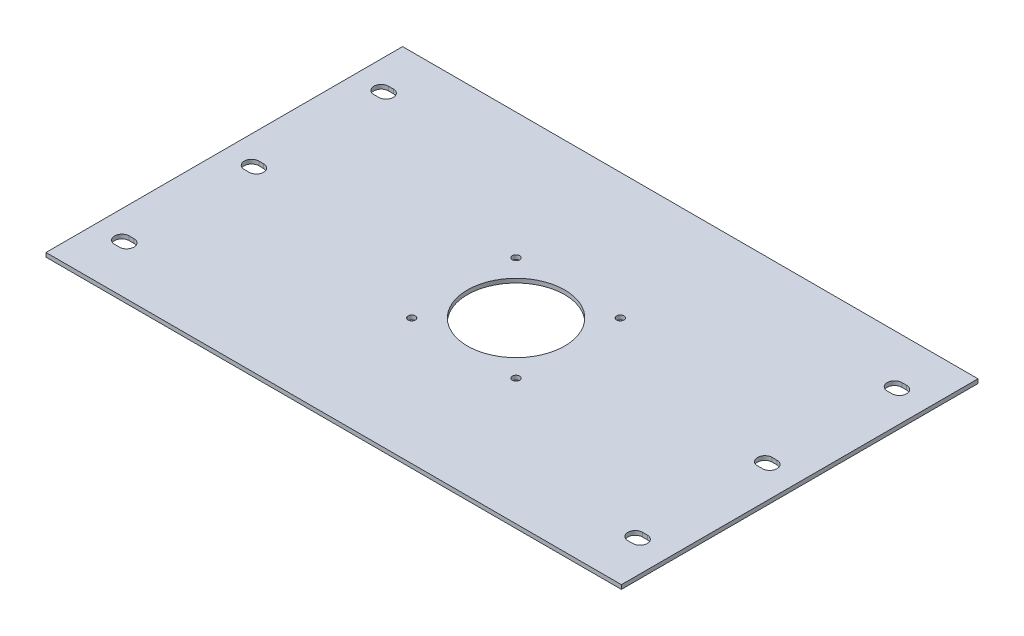
ISO-10303-21;
HEADER;
FILE_DESCRIPTION(('STEP AP214'),'2;1');
FILE_NAME('part.step','',(''),(''),'','','');
FILE_SCHEMA(('AUTOMOTIVE_DESIGN { 1 0 10303 214 1 1 1 1 }'));
ENDSEC;
DATA;
#1=APPLICATION_CONTEXT('core data for automotive mechanical design processes');
#2=APPLICATION_PROTOCOL_DEFINITION('international standard','automotive_design',2000,#1);
#3=PRODUCT_CONTEXT('',#1,'mechanical');
#4=PRODUCT('Part','Part','',(#3));
#5=PRODUCT_RELATED_PRODUCT_CATEGORY('part','',(#4));
#6=PRODUCT_DEFINITION_FORMATION('','',#4);
#7=PRODUCT_DEFINITION_CONTEXT('part definition',#1,'design');
#8=PRODUCT_DEFINITION('design','',#6,#7);
#9=PRODUCT_DEFINITION_SHAPE('','',#8);
#10=(LENGTH_UNIT() NAMED_UNIT(*) SI_UNIT(.MILLI.,.METRE.));
#11=(NAMED_UNIT(*) PLANE_ANGLE_UNIT() SI_UNIT($,.RADIAN.));
#12=(NAMED_UNIT(*) SI_UNIT($,.STERADIAN.) SOLID_ANGLE_UNIT());
#13=UNCERTAINTY_MEASURE_WITH_UNIT(LENGTH_MEASURE(1.E-05),#10,'distance_accuracy_value','');
#14=(GEOMETRIC_REPRESENTATION_CONTEXT(3) GLOBAL_UNCERTAINTY_ASSIGNED_CONTEXT((#13)) GLOBAL_UNIT_ASSIGNED_CONTEXT((#10,
#11,#12)) REPRESENTATION_CONTEXT('',''));
#15=CARTESIAN_POINT('',(0.,0.,0.));
#16=DIRECTION('',(0.,0.,1.));
#17=DIRECTION('',(1.,0.,0.));
#18=AXIS2_PLACEMENT_3D('',#15,#16,#17);
#19=CARTESIAN_POINT('',(0.,2.54,0.));
#20=DIRECTION('',(0.,1.,0.));
#21=DIRECTION('',(0.,0.,1.));
#22=AXIS2_PLACEMENT_3D('',#19,#20,#21);
#23=PLANE('',#22);
#24=CARTESIAN_POINT('',(147.121823505015,2.54,91.5096177824938));
#25=DIRECTION('',(0.,1.,0.));
#26=DIRECTION('',(0.,0.,1.));
#27=AXIS2_PLACEMENT_3D('',#24,#25,#26);
#28=CIRCLE('',#27,4.5);
#29=CARTESIAN_POINT('',(147.121823505015,2.54,87.0096177824938));
#30=VERTEX_POINT('',#29);
#31=CARTESIAN_POINT('',(147.121823505015,2.54,96.0096177824938));
#32=VERTEX_POINT('',#31);
#33=EDGE_CURVE('E679',#30,#32,#28,.T.);
#34=ORIENTED_EDGE('',*,*,#33,.F.);
#35=DIRECTION('',(-1.,0.,0.));
#36=VECTOR('',#35,1.);
#37=CARTESIAN_POINT('',(150.121823505015,2.54,87.0096177824938));
#38=LINE('',#37,#36);
#39=CARTESIAN_POINT('',(150.121823505015,2.54,87.0096177824938));
#40=VERTEX_POINT('',#39);
#41=EDGE_CURVE('E664',#40,#30,#38,.T.);
#42=ORIENTED_EDGE('',*,*,#41,.F.);
#43=CARTESIAN_POINT('',(150.121823505015,2.54,91.5096177824938));
#44=DIRECTION('',(0.,1.,0.));
#45=DIRECTION('',(0.,0.,1.));
#46=AXIS2_PLACEMENT_3D('',#43,#44,#45);
#47=CIRCLE('',#46,4.5);
#48=CARTESIAN_POINT('',(150.121823505015,2.54,96.0096177824938));
#49=VERTEX_POINT('',#48);
#50=EDGE_CURVE('E668',#49,#40,#47,.T.);
#51=ORIENTED_EDGE('',*,*,#50,.F.);
#52=DIRECTION('',(-1.,0.,0.));
#53=VECTOR('',#52,1.);
#54=CARTESIAN_POINT('',(150.121823505015,2.54,96.0096177824938));
#55=LINE('',#54,#53);
#56=EDGE_CURVE('E674',#49,#32,#55,.T.);
#57=ORIENTED_EDGE('',*,*,#56,.T.);
#58=EDGE_LOOP('',(#34,#42,#51,#57));
#59=FACE_BOUND('',#58,.T.);
#60=CARTESIAN_POINT('',(147.121823505015,2.54,11.5096177824938));
#61=DIRECTION('',(0.,1.,0.));
#62=DIRECTION('',(0.,0.,1.));
#63=AXIS2_PLACEMENT_3D('',#60,#61,#62);
#64=CIRCLE('',#63,4.5);
#65=CARTESIAN_POINT('',(147.121823505015,2.54,7.00961778249384));
#66=VERTEX_POINT('',#65);
#67=CARTESIAN_POINT('',(147.121823505015,2.54,16.0096177824938));
#68=VERTEX_POINT('',#67);
#69=EDGE_CURVE('E700',#66,#68,#64,.T.);
#70=ORIENTED_EDGE('',*,*,#69,.F.);
#71=DIRECTION('',(-1.,0.,0.));
#72=VECTOR('',#71,1.);
#73=CARTESIAN_POINT('',(150.121823505015,2.54,7.00961778249384));
#74=LINE('',#73,#72);
#75=CARTESIAN_POINT('',(150.121823505015,2.54,7.00961778249384));
#76=VERTEX_POINT('',#75);
#77=EDGE_CURVE('E688',#76,#66,#74,.T.);
#78=ORIENTED_EDGE('',*,*,#77,.F.);
#79=CARTESIAN_POINT('',(150.121823505015,2.54,11.5096177824938));
#80=DIRECTION('',(0.,1.,0.));
#81=DIRECTION('',(0.,0.,1.));
#82=AXIS2_PLACEMENT_3D('',#79,#80,#81);
#83=CIRCLE('',#82,4.5);
#84=CARTESIAN_POINT('',(150.121823505015,2.54,16.0096177824938));
#85=VERTEX_POINT('',#84);
#86=EDGE_CURVE('E693',#85,#76,#83,.T.);
#87=ORIENTED_EDGE('',*,*,#86,.F.);
#88=DIRECTION('',(-1.,0.,0.));
#89=VECTOR('',#88,1.);
#90=CARTESIAN_POINT('',(150.121823505015,2.54,16.0096177824938));
#91=LINE('',#90,#89);
#92=EDGE_CURVE('E690',#85,#68,#91,.T.);
#93=ORIENTED_EDGE('',*,*,#92,.T.);
#94=EDGE_LOOP('',(#70,#78,#87,#93));
#95=FACE_BOUND('',#94,.T.);
#96=CARTESIAN_POINT('',(147.121823505015,2.54,-68.4903822175062));
#97=DIRECTION('',(0.,1.,0.));
#98=DIRECTION('',(0.,0.,1.));
#99=AXIS2_PLACEMENT_3D('',#96,#97,#98);
#100=CIRCLE('',#99,4.5);
#101=CARTESIAN_POINT('',(147.121823505015,2.54,-72.9903822175062));
#102=VERTEX_POINT('',#101);
#103=CARTESIAN_POINT('',(147.121823505015,2.54,-63.9903822175062));
#104=VERTEX_POINT('',#103);
#105=EDGE_CURVE('E720',#102,#104,#100,.T.);
#106=ORIENTED_EDGE('',*,*,#105,.F.);
#107=DIRECTION('',(-1.,0.,0.));
#108=VECTOR('',#107,1.);
#109=CARTESIAN_POINT('',(150.121823505015,2.54,-72.9903822175062));
#110=LINE('',#109,#108);
#111=CARTESIAN_POINT('',(150.121823505015,2.54,-72.9903822175062));
#112=VERTEX_POINT('',#111);
#113=EDGE_CURVE('E708',#112,#102,#110,.T.);
#114=ORIENTED_EDGE('',*,*,#113,.F.);
#115=CARTESIAN_POINT('',(150.121823505015,2.54,-68.4903822175062));
#116=DIRECTION('',(0.,1.,0.));
#117=DIRECTION('',(0.,0.,1.));
#118=AXIS2_PLACEMENT_3D('',#115,#116,#117);
#119=CIRCLE('',#118,4.5);
#120=CARTESIAN_POINT('',(150.121823505015,2.54,-63.9903822175062));
#121=VERTEX_POINT('',#120);
#122=EDGE_CURVE('E713',#121,#112,#119,.T.);
#123=ORIENTED_EDGE('',*,*,#122,.F.);
#124=DIRECTION('',(-1.,0.,0.));
#125=VECTOR('',#124,1.);
#126=CARTESIAN_POINT('',(150.121823505015,2.54,-63.9903822175062));
#127=LINE('',#126,#125);
#128=EDGE_CURVE('E710',#121,#104,#127,.T.);
#129=ORIENTED_EDGE('',*,*,#128,.T.);
#130=EDGE_LOOP('',(#106,#114,#123,#129));
#131=FACE_BOUND('',#130,.T.);
#132=CARTESIAN_POINT('',(-169.579279891369,2.54,11.5096177824938));
#133=DIRECTION('',(0.,1.,0.));
#134=DIRECTION('',(0.,0.,1.));
#135=AXIS2_PLACEMENT_3D('',#132,#133,#134);
#136=CIRCLE('',#135,4.5);
#137=CARTESIAN_POINT('',(-169.579279891369,2.54,7.00961778249384));
#138=VERTEX_POINT('',#137);
#139=CARTESIAN_POINT('',(-169.579279891369,2.54,16.0096177824938));
#140=VERTEX_POINT('',#139);
#141=EDGE_CURVE('E740',#138,#140,#136,.T.);
#142=ORIENTED_EDGE('',*,*,#141,.F.);
#143=DIRECTION('',(-1.,0.,0.));
#144=VECTOR('',#143,1.);
#145=CARTESIAN_POINT('',(-166.579279891369,2.54,7.00961778249384));
#146=LINE('',#145,#144);
#147=CARTESIAN_POINT('',(-166.579279891369,2.54,7.0096177824938));
#148=VERTEX_POINT('',#147);
#149=EDGE_CURVE('E728',#148,#138,#146,.T.);
#150=ORIENTED_EDGE('',*,*,#149,.F.);
#151=CARTESIAN_POINT('',(-166.579279891369,2.54,11.5096177824938));
#152=DIRECTION('',(0.,1.,0.));
#153=DIRECTION('',(0.,0.,1.));
#154=AXIS2_PLACEMENT_3D('',#151,#152,#153);
#155=CIRCLE('',#154,4.5);
#156=CARTESIAN_POINT('',(-166.579279891369,2.54,16.0096177824938));
#157=VERTEX_POINT('',#156);
#158=EDGE_CURVE('E733',#157,#148,#155,.T.);
#159=ORIENTED_EDGE('',*,*,#158,.F.);
#160=DIRECTION('',(-1.,0.,0.));
#161=VECTOR('',#160,1.);
#162=CARTESIAN_POINT('',(-166.579279891369,2.54,16.0096177824938));
#163=LINE('',#162,#161);
#164=EDGE_CURVE('E730',#157,#140,#163,.T.);
#165=ORIENTED_EDGE('',*,*,#164,.T.);
#166=EDGE_LOOP('',(#142,#150,#159,#165));
#167=FACE_BOUND('',#166,.T.);
#168=CARTESIAN_POINT('',(-169.579279891369,2.54,91.5096177824938));
#169=DIRECTION('',(0.,1.,0.));
#170=DIRECTION('',(0.,0.,1.));
#171=AXIS2_PLACEMENT_3D('',#168,#169,#170);
#172=CIRCLE('',#171,4.5);
#173=CARTESIAN_POINT('',(-169.579279891369,2.54,87.0096177824938));
#174=VERTEX_POINT('',#173);
#175=CARTESIAN_POINT('',(-169.579279891369,2.54,96.0096177824938));
#176=VERTEX_POINT('',#175);
#177=EDGE_CURVE('E761',#174,#176,#172,.T.);
#178=ORIENTED_EDGE('',*,*,#177,.F.);
#179=DIRECTION('',(-1.,0.,0.));
#180=VECTOR('',#179,1.);
#181=CARTESIAN_POINT('',(-166.579279891369,2.54,87.0096177824938));
#182=LINE('',#181,#180);
#183=CARTESIAN_POINT('',(-166.579279891369,2.54,87.0096177824938));
#184=VERTEX_POINT('',#183);
#185=EDGE_CURVE('E748',#184,#174,#182,.T.);
#186=ORIENTED_EDGE('',*,*,#185,.F.);
#187=CARTESIAN_POINT('',(-166.579279891369,2.54,91.5096177824938));
#188=DIRECTION('',(0.,1.,0.));
#189=DIRECTION('',(0.,0.,1.));
#190=AXIS2_PLACEMENT_3D('',#187,#188,#189);
#191=CIRCLE('',#190,4.5);
#192=CARTESIAN_POINT('',(-166.579279891369,2.54,96.0096177824938));
#193=VERTEX_POINT('',#192);
#194=EDGE_CURVE('E753',#193,#184,#191,.T.);
#195=ORIENTED_EDGE('',*,*,#194,.F.);
#196=DIRECTION('',(-1.,0.,0.));
#197=VECTOR('',#196,1.);
#198=CARTESIAN_POINT('',(-166.579279891369,2.54,96.0096177824938));
#199=LINE('',#198,#197);
#200=EDGE_CURVE('E750',#193,#176,#199,.T.);
#201=ORIENTED_EDGE('',*,*,#200,.T.);
#202=EDGE_LOOP('',(#178,#186,#195,#201));
#203=FACE_BOUND('',#202,.T.);
#204=CARTESIAN_POINT('',(25.7968235050178,2.54,-20.6653822175063));
#205=DIRECTION('',(0.,-1.,0.));
#206=DIRECTION('',(0.,0.,-1.));
#207=AXIS2_PLACEMENT_3D('',#204,#205,#206);
#208=CIRCLE('',#207,2.25);
#209=CARTESIAN_POINT('',(25.7968235050178,2.54,-22.9153822175063));
#210=VERTEX_POINT('',#209);
#211=EDGE_CURVE('E835',#210,#210,#208,.T.);
#212=ORIENTED_EDGE('',*,*,#211,.T.);
#213=EDGE_LOOP('',(#212));
#214=FACE_BOUND('',#213,.T.);
#215=CARTESIAN_POINT('',(25.7968235050178,2.54,43.6846177824982));
#216=DIRECTION('',(0.,-1.,0.));
#217=DIRECTION('',(0.,0.,-1.));
#218=AXIS2_PLACEMENT_3D('',#215,#216,#217);
#219=CIRCLE('',#218,2.25);
#220=CARTESIAN_POINT('',(25.7968235050178,2.54,41.4346177824982));
#221=VERTEX_POINT('',#220);
#222=EDGE_CURVE('E842',#221,#221,#219,.T.);
#223=ORIENTED_EDGE('',*,*,#222,.T.);
#224=EDGE_LOOP('',(#223));
#225=FACE_BOUND('',#224,.T.);
#226=CARTESIAN_POINT('',(-6.37817649498451,2.54,11.5096177824959));
#227=DIRECTION('',(0.,-1.,0.));
#228=DIRECTION('',(0.,0.,-1.));
#229=AXIS2_PLACEMENT_3D('',#226,#227,#228);
#230=CIRCLE('',#229,30.);
#231=CARTESIAN_POINT('',(-6.37817649498451,2.54,-18.4903822175041));
#232=VERTEX_POINT('',#231);
#233=EDGE_CURVE('E823',#232,#232,#230,.T.);
#234=ORIENTED_EDGE('',*,*,#233,.T.);
#235=EDGE_LOOP('',(#234));
#236=FACE_BOUND('',#235,.T.);
#237=CARTESIAN_POINT('',(-38.5531764949868,2.54,43.6846177824982));
#238=DIRECTION('',(0.,-1.,0.));
#239=DIRECTION('',(0.,0.,-1.));
#240=AXIS2_PLACEMENT_3D('',#237,#238,#239);
#241=CIRCLE('',#240,2.25);
#242=CARTESIAN_POINT('',(-38.5531764949868,2.54,41.4346177824982));
#243=VERTEX_POINT('',#242);
#244=EDGE_CURVE('E829',#243,#243,#241,.T.);
#245=ORIENTED_EDGE('',*,*,#244,.T.);
#246=EDGE_LOOP('',(#245));
#247=FACE_BOUND('',#246,.T.);
#248=CARTESIAN_POINT('',(-38.5531764949868,2.54,-20.6653822175063));
#249=DIRECTION('',(0.,-1.,0.));
#250=DIRECTION('',(0.,0.,-1.));
#251=AXIS2_PLACEMENT_3D('',#248,#249,#250);
#252=CIRCLE('',#251,2.25);
#253=CARTESIAN_POINT('',(-38.5531764949868,2.54,-22.9153822175064));
#254=VERTEX_POINT('',#253);
#255=EDGE_CURVE('E847',#254,#254,#252,.T.);
#256=ORIENTED_EDGE('',*,*,#255,.T.);
#257=EDGE_LOOP('',(#256));
#258=FACE_BOUND('',#257,.T.);
#259=DIRECTION('',(0.,0.,1.));
#260=VECTOR('',#259,1.);
#261=CARTESIAN_POINT('',(-186.378176494985,2.54,61.5096177824938));
#262=LINE('',#261,#260);
#263=CARTESIAN_POINT('',(-186.378176494985,2.54,-98.4903822175062));
#264=VERTEX_POINT('',#263);
#265=CARTESIAN_POINT('',(-186.378176494985,2.54,121.509617782494));
#266=VERTEX_POINT('',#265);
#267=EDGE_CURVE('E819',#264,#266,#262,.T.);
#268=ORIENTED_EDGE('',*,*,#267,.T.);
#269=DIRECTION('',(-1.,0.,0.));
#270=VECTOR('',#269,1.);
#271=CARTESIAN_POINT('',(168.621823505015,2.54,121.509617782494));
#272=LINE('',#271,#270);
#273=CARTESIAN_POINT('',(168.621823505015,2.54,121.509617782494));
#274=VERTEX_POINT('',#273);
#275=EDGE_CURVE('E793',#274,#266,#272,.T.);
#276=ORIENTED_EDGE('',*,*,#275,.F.);
#277=DIRECTION('',(0.,0.,1.));
#278=VECTOR('',#277,1.);
#279=CARTESIAN_POINT('',(168.621823505015,2.54,61.5096177824938));
#280=LINE('',#279,#278);
#281=CARTESIAN_POINT('',(168.621823505015,2.54,-98.4903822175062));
#282=VERTEX_POINT('',#281);
#283=EDGE_CURVE('E816',#282,#274,#280,.T.);
#284=ORIENTED_EDGE('',*,*,#283,.F.);
#285=DIRECTION('',(1.,0.,0.));
#286=VECTOR('',#285,1.);
#287=CARTESIAN_POINT('',(-186.378176494985,2.54,-98.4903822175062));
#288=LINE('',#287,#286);
#289=EDGE_CURVE('E805',#264,#282,#288,.T.);
#290=ORIENTED_EDGE('',*,*,#289,.F.);
#291=EDGE_LOOP('',(#268,#276,#284,#290));
#292=FACE_BOUND('',#291,.T.);
#293=CARTESIAN_POINT('',(-166.579279891369,2.54,-68.4903822175062));
#294=DIRECTION('',(0.,1.,0.));
#295=DIRECTION('',(0.,0.,1.));
#296=AXIS2_PLACEMENT_3D('',#293,#294,#295);
#297=CIRCLE('',#296,4.5);
#298=CARTESIAN_POINT('',(-166.579279891369,2.54,-63.9903822175062));
#299=VERTEX_POINT('',#298);
#300=CARTESIAN_POINT('',(-166.579279891369,2.54,-72.9903822175062));
#301=VERTEX_POINT('',#300);
#302=EDGE_CURVE('E774',#299,#301,#297,.T.);
#303=ORIENTED_EDGE('',*,*,#302,.F.);
#304=DIRECTION('',(-1.,0.,0.));
#305=VECTOR('',#304,1.);
#306=CARTESIAN_POINT('',(-166.579279891369,2.54,-63.9903822175062));
#307=LINE('',#306,#305);
#308=CARTESIAN_POINT('',(-169.579279891369,2.54,-63.9903822175062));
#309=VERTEX_POINT('',#308);
#310=EDGE_CURVE('E771',#299,#309,#307,.T.);
#311=ORIENTED_EDGE('',*,*,#310,.T.);
#312=CARTESIAN_POINT('',(-169.579279891369,2.54,-68.4903822175062));
#313=DIRECTION('',(0.,1.,0.));
#314=DIRECTION('',(0.,0.,1.));
#315=AXIS2_PLACEMENT_3D('',#312,#313,#314);
#316=CIRCLE('',#315,4.5);
#317=CARTESIAN_POINT('',(-169.579279891369,2.54,-72.9903822175062));
#318=VERTEX_POINT('',#317);
#319=EDGE_CURVE('E782',#318,#309,#316,.T.);
#320=ORIENTED_EDGE('',*,*,#319,.F.);
#321=DIRECTION('',(-1.,0.,0.));
#322=VECTOR('',#321,1.);
#323=CARTESIAN_POINT('',(-166.579279891369,2.54,-72.9903822175062));
#324=LINE('',#323,#322);
#325=EDGE_CURVE('E769',#301,#318,#324,.T.);
#326=ORIENTED_EDGE('',*,*,#325,.F.);
#327=EDGE_LOOP('',(#303,#311,#320,#326));
#328=FACE_BOUND('',#327,.T.);
#329=ADVANCED_FACE('F477',(#59,#95,#131,#167,#203,#214,#225,#236,#247,#258,#292,#328),#23,.T.);
#330=CARTESIAN_POINT('',(0.,0.,0.));
#331=DIRECTION('',(0.,1.,0.));
#332=DIRECTION('',(0.,0.,1.));
#333=AXIS2_PLACEMENT_3D('',#330,#331,#332);
#334=PLANE('',#333);
#335=DIRECTION('',(-1.,0.,0.));
#336=VECTOR('',#335,1.);
#337=CARTESIAN_POINT('',(0.,0.,87.0096177824938));
#338=LINE('',#337,#336);
#339=CARTESIAN_POINT('',(150.121823505015,0.,87.0096177824938));
#340=VERTEX_POINT('',#339);
#341=CARTESIAN_POINT('',(147.121823505015,0.,87.0096177824938));
#342=VERTEX_POINT('',#341);
#343=EDGE_CURVE('E666',#340,#342,#338,.T.);
#344=ORIENTED_EDGE('',*,*,#343,.T.);
#345=CARTESIAN_POINT('',(147.121823505015,0.,91.5096177824938));
#346=DIRECTION('',(0.,1.,0.));
#347=DIRECTION('',(0.,0.,1.));
#348=AXIS2_PLACEMENT_3D('',#345,#346,#347);
#349=CIRCLE('',#348,4.5);
#350=CARTESIAN_POINT('',(147.121823505015,0.,96.0096177824938));
#351=VERTEX_POINT('',#350);
#352=EDGE_CURVE('E13',#342,#351,#349,.T.);
#353=ORIENTED_EDGE('',*,*,#352,.T.);
#354=DIRECTION('',(1.,0.,0.));
#355=VECTOR('',#354,1.);
#356=CARTESIAN_POINT('',(0.,0.,96.0096177824938));
#357=LINE('',#356,#355);
#358=CARTESIAN_POINT('',(150.121823505015,0.,96.0096177824938));
#359=VERTEX_POINT('',#358);
#360=EDGE_CURVE('E485',#351,#359,#357,.T.);
#361=ORIENTED_EDGE('',*,*,#360,.T.);
#362=CARTESIAN_POINT('',(150.121823505015,0.,91.5096177824938));
#363=DIRECTION('',(0.,1.,0.));
#364=DIRECTION('',(0.,0.,1.));
#365=AXIS2_PLACEMENT_3D('',#362,#363,#364);
#366=CIRCLE('',#365,4.5);
#367=EDGE_CURVE('E913',#359,#340,#366,.T.);
#368=ORIENTED_EDGE('',*,*,#367,.T.);
#369=EDGE_LOOP('',(#344,#353,#361,#368));
#370=FACE_BOUND('',#369,.T.);
#371=DIRECTION('',(-1.,0.,0.));
#372=VECTOR('',#371,1.);
#373=CARTESIAN_POINT('',(0.,0.,7.0096177824938));
#374=LINE('',#373,#372);
#375=CARTESIAN_POINT('',(150.121823505015,0.,7.0096177824938));
#376=VERTEX_POINT('',#375);
#377=CARTESIAN_POINT('',(147.121823505015,0.,7.0096177824938));
#378=VERTEX_POINT('',#377);
#379=EDGE_CURVE('E906',#376,#378,#374,.T.);
#380=ORIENTED_EDGE('',*,*,#379,.T.);
#381=CARTESIAN_POINT('',(147.121823505015,0.,11.5096177824938));
#382=DIRECTION('',(0.,1.,0.));
#383=DIRECTION('',(0.,0.,1.));
#384=AXIS2_PLACEMENT_3D('',#381,#382,#383);
#385=CIRCLE('',#384,4.5);
#386=CARTESIAN_POINT('',(147.121823505015,0.,16.0096177824938));
#387=VERTEX_POINT('',#386);
#388=EDGE_CURVE('E909',#378,#387,#385,.T.);
#389=ORIENTED_EDGE('',*,*,#388,.T.);
#390=DIRECTION('',(1.,0.,0.));
#391=VECTOR('',#390,1.);
#392=CARTESIAN_POINT('',(0.,0.,16.0096177824938));
#393=LINE('',#392,#391);
#394=CARTESIAN_POINT('',(150.121823505015,0.,16.0096177824938));
#395=VERTEX_POINT('',#394);
#396=EDGE_CURVE('E900',#387,#395,#393,.T.);
#397=ORIENTED_EDGE('',*,*,#396,.T.);
#398=CARTESIAN_POINT('',(150.121823505015,0.,11.5096177824938));
#399=DIRECTION('',(0.,1.,0.));
#400=DIRECTION('',(0.,0.,1.));
#401=AXIS2_PLACEMENT_3D('',#398,#399,#400);
#402=CIRCLE('',#401,4.5);
#403=EDGE_CURVE('E903',#395,#376,#402,.T.);
#404=ORIENTED_EDGE('',*,*,#403,.T.);
#405=EDGE_LOOP('',(#380,#389,#397,#404));
#406=FACE_BOUND('',#405,.T.);
#407=DIRECTION('',(-1.,0.,0.));
#408=VECTOR('',#407,1.);
#409=CARTESIAN_POINT('',(0.,0.,-72.9903822175062));
#410=LINE('',#409,#408);
#411=CARTESIAN_POINT('',(150.121823505015,0.,-72.9903822175062));
#412=VERTEX_POINT('',#411);
#413=CARTESIAN_POINT('',(147.121823505015,0.,-72.9903822175062));
#414=VERTEX_POINT('',#413);
#415=EDGE_CURVE('E894',#412,#414,#410,.T.);
#416=ORIENTED_EDGE('',*,*,#415,.T.);
#417=CARTESIAN_POINT('',(147.121823505015,0.,-68.4903822175062));
#418=DIRECTION('',(0.,1.,0.));
#419=DIRECTION('',(0.,0.,1.));
#420=AXIS2_PLACEMENT_3D('',#417,#418,#419);
#421=CIRCLE('',#420,4.5);
#422=CARTESIAN_POINT('',(147.121823505015,0.,-63.9903822175062));
#423=VERTEX_POINT('',#422);
#424=EDGE_CURVE('E897',#414,#423,#421,.T.);
#425=ORIENTED_EDGE('',*,*,#424,.T.);
#426=DIRECTION('',(1.,0.,0.));
#427=VECTOR('',#426,1.);
#428=CARTESIAN_POINT('',(0.,0.,-63.9903822175062));
#429=LINE('',#428,#427);
#430=CARTESIAN_POINT('',(150.121823505015,0.,-63.9903822175062));
#431=VERTEX_POINT('',#430);
#432=EDGE_CURVE('E888',#423,#431,#429,.T.);
#433=ORIENTED_EDGE('',*,*,#432,.T.);
#434=CARTESIAN_POINT('',(150.121823505015,0.,-68.4903822175062));
#435=DIRECTION('',(0.,1.,0.));
#436=DIRECTION('',(0.,0.,1.));
#437=AXIS2_PLACEMENT_3D('',#434,#435,#436);
#438=CIRCLE('',#437,4.5);
#439=EDGE_CURVE('E891',#431,#412,#438,.T.);
#440=ORIENTED_EDGE('',*,*,#439,.T.);
#441=EDGE_LOOP('',(#416,#425,#433,#440));
#442=FACE_BOUND('',#441,.T.);
#443=CARTESIAN_POINT('',(-166.579279891369,0.,11.5096177824938));
#444=DIRECTION('',(0.,1.,0.));
#445=DIRECTION('',(0.,0.,1.));
#446=AXIS2_PLACEMENT_3D('',#443,#444,#445);
#447=CIRCLE('',#446,4.5);
#448=CARTESIAN_POINT('',(-166.579279891369,0.,16.0096177824938));
#449=VERTEX_POINT('',#448);
#450=CARTESIAN_POINT('',(-166.579279891369,0.,7.0096177824938));
#451=VERTEX_POINT('',#450);
#452=EDGE_CURVE('E879',#449,#451,#447,.T.);
#453=ORIENTED_EDGE('',*,*,#452,.T.);
#454=DIRECTION('',(-1.,0.,0.));
#455=VECTOR('',#454,1.);
#456=CARTESIAN_POINT('',(0.,0.,7.0096177824938));
#457=LINE('',#456,#455);
#458=CARTESIAN_POINT('',(-169.579279891369,0.,7.0096177824938));
#459=VERTEX_POINT('',#458);
#460=EDGE_CURVE('E885',#451,#459,#457,.T.);
#461=ORIENTED_EDGE('',*,*,#460,.T.);
#462=CARTESIAN_POINT('',(-169.579279891369,0.,11.5096177824938));
#463=DIRECTION('',(0.,1.,0.));
#464=DIRECTION('',(0.,0.,1.));
#465=AXIS2_PLACEMENT_3D('',#462,#463,#464);
#466=CIRCLE('',#465,4.5);
#467=CARTESIAN_POINT('',(-169.579279891369,0.,16.0096177824938));
#468=VERTEX_POINT('',#467);
#469=EDGE_CURVE('E882',#459,#468,#466,.T.);
#470=ORIENTED_EDGE('',*,*,#469,.T.);
#471=DIRECTION('',(1.,0.,0.));
#472=VECTOR('',#471,1.);
#473=CARTESIAN_POINT('',(0.,0.,16.0096177824938));
#474=LINE('',#473,#472);
#475=EDGE_CURVE('E876',#468,#449,#474,.T.);
#476=ORIENTED_EDGE('',*,*,#475,.T.);
#477=EDGE_LOOP('',(#453,#461,#470,#476));
#478=FACE_BOUND('',#477,.T.);
#479=DIRECTION('',(1.,0.,0.));
#480=VECTOR('',#479,1.);
#481=CARTESIAN_POINT('',(0.,0.,96.0096177824938));
#482=LINE('',#481,#480);
#483=CARTESIAN_POINT('',(-169.579279891369,0.,96.0096177824938));
#484=VERTEX_POINT('',#483);
#485=CARTESIAN_POINT('',(-166.579279891369,0.,96.0096177824938));
#486=VERTEX_POINT('',#485);
#487=EDGE_CURVE('E867',#484,#486,#482,.T.);
#488=ORIENTED_EDGE('',*,*,#487,.T.);
#489=CARTESIAN_POINT('',(-166.579279891369,0.,91.5096177824938));
#490=DIRECTION('',(0.,1.,0.));
#491=DIRECTION('',(0.,0.,1.));
#492=AXIS2_PLACEMENT_3D('',#489,#490,#491);
#493=CIRCLE('',#492,4.5);
#494=CARTESIAN_POINT('',(-166.579279891369,0.,87.0096177824938));
#495=VERTEX_POINT('',#494);
#496=EDGE_CURVE('E873',#486,#495,#493,.T.);
#497=ORIENTED_EDGE('',*,*,#496,.T.);
#498=DIRECTION('',(-1.,0.,0.));
#499=VECTOR('',#498,1.);
#500=CARTESIAN_POINT('',(0.,0.,87.0096177824938));
#501=LINE('',#500,#499);
#502=CARTESIAN_POINT('',(-169.579279891369,0.,87.0096177824938));
#503=VERTEX_POINT('',#502);
#504=EDGE_CURVE('E870',#495,#503,#501,.T.);
#505=ORIENTED_EDGE('',*,*,#504,.T.);
#506=CARTESIAN_POINT('',(-169.579279891369,0.,91.5096177824938));
#507=DIRECTION('',(0.,1.,0.));
#508=DIRECTION('',(0.,0.,1.));
#509=AXIS2_PLACEMENT_3D('',#506,#507,#508);
#510=CIRCLE('',#509,4.5);
#511=EDGE_CURVE('E864',#503,#484,#510,.T.);
#512=ORIENTED_EDGE('',*,*,#511,.T.);
#513=EDGE_LOOP('',(#488,#497,#505,#512));
#514=FACE_BOUND('',#513,.T.);
#515=DIRECTION('',(1.,0.,0.));
#516=VECTOR('',#515,1.);
#517=CARTESIAN_POINT('',(0.,0.,-63.9903822175062));
#518=LINE('',#517,#516);
#519=CARTESIAN_POINT('',(-169.579279891369,0.,-63.9903822175062));
#520=VERTEX_POINT('',#519);
#521=CARTESIAN_POINT('',(-166.579279891369,0.,-63.9903822175062));
#522=VERTEX_POINT('',#521);
#523=EDGE_CURVE('E858',#520,#522,#518,.T.);
#524=ORIENTED_EDGE('',*,*,#523,.T.);
#525=CARTESIAN_POINT('',(-166.579279891369,0.,-68.4903822175062));
#526=DIRECTION('',(0.,1.,0.));
#527=DIRECTION('',(0.,0.,1.));
#528=AXIS2_PLACEMENT_3D('',#525,#526,#527);
#529=CIRCLE('',#528,4.5);
#530=CARTESIAN_POINT('',(-166.579279891369,0.,-72.9903822175062));
#531=VERTEX_POINT('',#530);
#532=EDGE_CURVE('E861',#522,#531,#529,.T.);
#533=ORIENTED_EDGE('',*,*,#532,.T.);
#534=DIRECTION('',(-1.,0.,0.));
#535=VECTOR('',#534,1.);
#536=CARTESIAN_POINT('',(0.,0.,-72.9903822175062));
#537=LINE('',#536,#535);
#538=CARTESIAN_POINT('',(-169.579279891369,0.,-72.9903822175062));
#539=VERTEX_POINT('',#538);
#540=EDGE_CURVE('E855',#531,#539,#537,.T.);
#541=ORIENTED_EDGE('',*,*,#540,.T.);
#542=CARTESIAN_POINT('',(-169.579279891369,0.,-68.4903822175062));
#543=DIRECTION('',(0.,1.,0.));
#544=DIRECTION('',(0.,0.,1.));
#545=AXIS2_PLACEMENT_3D('',#542,#543,#544);
#546=CIRCLE('',#545,4.5);
#547=EDGE_CURVE('E850',#539,#520,#546,.T.);
#548=ORIENTED_EDGE('',*,*,#547,.T.);
#549=EDGE_LOOP('',(#524,#533,#541,#548));
#550=FACE_BOUND('',#549,.T.);
#551=CARTESIAN_POINT('',(-38.5531764949868,0.,-20.6653822175063));
#552=DIRECTION('',(0.,-1.,0.));
#553=DIRECTION('',(0.,0.,-1.));
#554=AXIS2_PLACEMENT_3D('',#551,#552,#553);
#555=CIRCLE('',#554,2.25);
#556=CARTESIAN_POINT('',(-38.5531764949868,0.,-22.9153822175064));
#557=VERTEX_POINT('',#556);
#558=EDGE_CURVE('E838',#557,#557,#555,.T.);
#559=ORIENTED_EDGE('',*,*,#558,.F.);
#560=EDGE_LOOP('',(#559));
#561=FACE_BOUND('',#560,.T.);
#562=CARTESIAN_POINT('',(-38.5531764949868,0.,43.6846177824982));
#563=DIRECTION('',(0.,-1.,0.));
#564=DIRECTION('',(0.,0.,-1.));
#565=AXIS2_PLACEMENT_3D('',#562,#563,#564);
#566=CIRCLE('',#565,2.25);
#567=CARTESIAN_POINT('',(-38.5531764949868,0.,41.4346177824982));
#568=VERTEX_POINT('',#567);
#569=EDGE_CURVE('E826',#568,#568,#566,.T.);
#570=ORIENTED_EDGE('',*,*,#569,.F.);
#571=EDGE_LOOP('',(#570));
#572=FACE_BOUND('',#571,.T.);
#573=CARTESIAN_POINT('',(-6.37817649498451,0.,11.5096177824959));
#574=DIRECTION('',(0.,-1.,0.));
#575=DIRECTION('',(0.,0.,-1.));
#576=AXIS2_PLACEMENT_3D('',#573,#574,#575);
#577=CIRCLE('',#576,30.);
#578=CARTESIAN_POINT('',(-6.37817649498451,0.,-18.4903822175041));
#579=VERTEX_POINT('',#578);
#580=EDGE_CURVE('E821',#579,#579,#577,.T.);
#581=ORIENTED_EDGE('',*,*,#580,.F.);
#582=EDGE_LOOP('',(#581));
#583=FACE_BOUND('',#582,.T.);
#584=CARTESIAN_POINT('',(25.7968235050178,0.,43.6846177824982));
#585=DIRECTION('',(0.,-1.,0.));
#586=DIRECTION('',(0.,0.,-1.));
#587=AXIS2_PLACEMENT_3D('',#584,#585,#586);
#588=CIRCLE('',#587,2.25);
#589=CARTESIAN_POINT('',(25.7968235050178,0.,41.4346177824982));
#590=VERTEX_POINT('',#589);
#591=EDGE_CURVE('E832',#590,#590,#588,.T.);
#592=ORIENTED_EDGE('',*,*,#591,.F.);
#593=EDGE_LOOP('',(#592));
#594=FACE_BOUND('',#593,.T.);
#595=CARTESIAN_POINT('',(25.7968235050178,0.,-20.6653822175063));
#596=DIRECTION('',(0.,-1.,0.));
#597=DIRECTION('',(0.,0.,-1.));
#598=AXIS2_PLACEMENT_3D('',#595,#596,#597);
#599=CIRCLE('',#598,2.25);
#600=CARTESIAN_POINT('',(25.7968235050178,0.,-22.9153822175063));
#601=VERTEX_POINT('',#600);
#602=EDGE_CURVE('E839',#601,#601,#599,.T.);
#603=ORIENTED_EDGE('',*,*,#602,.F.);
#604=EDGE_LOOP('',(#603));
#605=FACE_BOUND('',#604,.T.);
#606=DIRECTION('',(0.,0.,-1.));
#607=VECTOR('',#606,1.);
#608=CARTESIAN_POINT('',(168.621823505015,0.,61.5096177824938));
#609=LINE('',#608,#607);
#610=CARTESIAN_POINT('',(168.621823505015,0.,121.509617782494));
#611=VERTEX_POINT('',#610);
#612=CARTESIAN_POINT('',(168.621823505015,0.,-98.4903822175062));
#613=VERTEX_POINT('',#612);
#614=EDGE_CURVE('E814',#611,#613,#609,.T.);
#615=ORIENTED_EDGE('',*,*,#614,.F.);
#616=DIRECTION('',(1.,0.,0.));
#617=VECTOR('',#616,1.);
#618=CARTESIAN_POINT('',(168.621823505015,0.,121.509617782494));
#619=LINE('',#618,#617);
#620=CARTESIAN_POINT('',(-186.378176494985,0.,121.509617782494));
#621=VERTEX_POINT('',#620);
#622=EDGE_CURVE('E799',#621,#611,#619,.T.);
#623=ORIENTED_EDGE('',*,*,#622,.F.);
#624=DIRECTION('',(0.,0.,-1.));
#625=VECTOR('',#624,1.);
#626=CARTESIAN_POINT('',(-186.378176494985,0.,61.5096177824938));
#627=LINE('',#626,#625);
#628=CARTESIAN_POINT('',(-186.378176494985,0.,-98.4903822175062));
#629=VERTEX_POINT('',#628);
#630=EDGE_CURVE('E818',#621,#629,#627,.T.);
#631=ORIENTED_EDGE('',*,*,#630,.T.);
#632=DIRECTION('',(-1.,0.,0.));
#633=VECTOR('',#632,1.);
#634=CARTESIAN_POINT('',(-186.378176494985,0.,-98.4903822175062));
#635=LINE('',#634,#633);
#636=EDGE_CURVE('E811',#613,#629,#635,.T.);
#637=ORIENTED_EDGE('',*,*,#636,.F.);
#638=EDGE_LOOP('',(#615,#623,#631,#637));
#639=FACE_BOUND('',#638,.T.);
#640=ADVANCED_FACE('F479',(#370,#406,#442,#478,#514,#550,#561,#572,#583,#594,#605,#639),#334,.F.);
#641=CARTESIAN_POINT('',(-38.5531764949868,2.54,-20.6653822175063));
#642=DIRECTION('',(0.,-1.,0.));
#643=DIRECTION('',(0.,0.,-1.));
#644=AXIS2_PLACEMENT_3D('',#641,#642,#643);
#645=CYLINDRICAL_SURFACE('',#644,2.25);
#646=ORIENTED_EDGE('',*,*,#255,.F.);
#647=EDGE_LOOP('',(#646));
#648=FACE_BOUND('',#647,.T.);
#649=ORIENTED_EDGE('',*,*,#558,.T.);
#650=EDGE_LOOP('',(#649));
#651=FACE_BOUND('',#650,.T.);
#652=ADVANCED_FACE('F939',(#648,#651),#645,.F.);
#653=CARTESIAN_POINT('',(-38.5531764949868,2.54,43.6846177824982));
#654=DIRECTION('',(0.,-1.,0.));
#655=DIRECTION('',(0.,0.,-1.));
#656=AXIS2_PLACEMENT_3D('',#653,#654,#655);
#657=CYLINDRICAL_SURFACE('',#656,2.25);
#658=ORIENTED_EDGE('',*,*,#244,.F.);
#659=EDGE_LOOP('',(#658));
#660=FACE_BOUND('',#659,.T.);
#661=ORIENTED_EDGE('',*,*,#569,.T.);
#662=EDGE_LOOP('',(#661));
#663=FACE_BOUND('',#662,.T.);
#664=ADVANCED_FACE('F943',(#660,#663),#657,.F.);
#665=CARTESIAN_POINT('',(-6.37817649498451,2.54,11.5096177824959));
#666=DIRECTION('',(0.,-1.,0.));
#667=DIRECTION('',(0.,0.,-1.));
#668=AXIS2_PLACEMENT_3D('',#665,#666,#667);
#669=CYLINDRICAL_SURFACE('',#668,30.);
#670=ORIENTED_EDGE('',*,*,#233,.F.);
#671=EDGE_LOOP('',(#670));
#672=FACE_BOUND('',#671,.T.);
#673=ORIENTED_EDGE('',*,*,#580,.T.);
#674=EDGE_LOOP('',(#673));
#675=FACE_BOUND('',#674,.T.);
#676=ADVANCED_FACE('F949',(#672,#675),#669,.F.);
#677=CARTESIAN_POINT('',(25.7968235050178,2.54,43.6846177824982));
#678=DIRECTION('',(0.,-1.,0.));
#679=DIRECTION('',(0.,0.,-1.));
#680=AXIS2_PLACEMENT_3D('',#677,#678,#679);
#681=CYLINDRICAL_SURFACE('',#680,2.25);
#682=ORIENTED_EDGE('',*,*,#222,.F.);
#683=EDGE_LOOP('',(#682));
#684=FACE_BOUND('',#683,.T.);
#685=ORIENTED_EDGE('',*,*,#591,.T.);
#686=EDGE_LOOP('',(#685));
#687=FACE_BOUND('',#686,.T.);
#688=ADVANCED_FACE('F945',(#684,#687),#681,.F.);
#689=CARTESIAN_POINT('',(25.7968235050178,2.54,-20.6653822175063));
#690=DIRECTION('',(0.,-1.,0.));
#691=DIRECTION('',(0.,0.,-1.));
#692=AXIS2_PLACEMENT_3D('',#689,#690,#691);
#693=CYLINDRICAL_SURFACE('',#692,2.25);
#694=ORIENTED_EDGE('',*,*,#211,.F.);
#695=EDGE_LOOP('',(#694));
#696=FACE_BOUND('',#695,.T.);
#697=ORIENTED_EDGE('',*,*,#602,.T.);
#698=EDGE_LOOP('',(#697));
#699=FACE_BOUND('',#698,.T.);
#700=ADVANCED_FACE('F948',(#696,#699),#693,.F.);
#701=CARTESIAN_POINT('',(-186.378176494985,-3.04800000000013,61.187617782496));
#702=DIRECTION('',(1.,0.,0.));
#703=DIRECTION('',(0.,1.,0.));
#704=AXIS2_PLACEMENT_3D('',#701,#702,#703);
#705=PLANE('',#704);
#706=ORIENTED_EDGE('',*,*,#267,.F.);
#707=DIRECTION('',(0.,1.,0.));
#708=VECTOR('',#707,1.);
#709=CARTESIAN_POINT('',(-186.378176494985,0.,-98.4903822175062));
#710=LINE('',#709,#708);
#711=EDGE_CURVE('E802',#629,#264,#710,.T.);
#712=ORIENTED_EDGE('',*,*,#711,.F.);
#713=ORIENTED_EDGE('',*,*,#630,.F.);
#714=DIRECTION('',(0.,-1.,0.));
#715=VECTOR('',#714,1.);
#716=CARTESIAN_POINT('',(-186.378176494985,0.,121.509617782494));
#717=LINE('',#716,#715);
#718=EDGE_CURVE('E796',#266,#621,#717,.T.);
#719=ORIENTED_EDGE('',*,*,#718,.F.);
#720=EDGE_LOOP('',(#706,#712,#713,#719));
#721=FACE_BOUND('',#720,.T.);
#722=ADVANCED_FACE('F953',(#721),#705,.F.);
#723=CARTESIAN_POINT('',(168.621823505015,0.,0.));
#724=DIRECTION('',(1.,0.,0.));
#725=DIRECTION('',(0.,0.,-1.));
#726=AXIS2_PLACEMENT_3D('',#723,#724,#725);
#727=PLANE('',#726);
#728=ORIENTED_EDGE('',*,*,#283,.T.);
#729=DIRECTION('',(0.,1.,0.));
#730=VECTOR('',#729,1.);
#731=CARTESIAN_POINT('',(168.621823505015,0.,121.509617782494));
#732=LINE('',#731,#730);
#733=EDGE_CURVE('E790',#611,#274,#732,.T.);
#734=ORIENTED_EDGE('',*,*,#733,.F.);
#735=ORIENTED_EDGE('',*,*,#614,.T.);
#736=DIRECTION('',(0.,-1.,0.));
#737=VECTOR('',#736,1.);
#738=CARTESIAN_POINT('',(168.621823505015,0.,-98.4903822175062));
#739=LINE('',#738,#737);
#740=EDGE_CURVE('E808',#282,#613,#739,.T.);
#741=ORIENTED_EDGE('',*,*,#740,.F.);
#742=EDGE_LOOP('',(#728,#734,#735,#741));
#743=FACE_BOUND('',#742,.T.);
#744=ADVANCED_FACE('F963',(#743),#727,.T.);
#745=CARTESIAN_POINT('',(0.,0.,-98.4903822175062));
#746=DIRECTION('',(0.,0.,-1.));
#747=DIRECTION('',(-1.,0.,0.));
#748=AXIS2_PLACEMENT_3D('',#745,#746,#747);
#749=PLANE('',#748);
#750=ORIENTED_EDGE('',*,*,#711,.T.);
#751=ORIENTED_EDGE('',*,*,#289,.T.);
#752=ORIENTED_EDGE('',*,*,#740,.T.);
#753=ORIENTED_EDGE('',*,*,#636,.T.);
#754=EDGE_LOOP('',(#750,#751,#752,#753));
#755=FACE_BOUND('',#754,.T.);
#756=ADVANCED_FACE('F967',(#755),#749,.T.);
#757=CARTESIAN_POINT('',(0.,0.,121.509617782494));
#758=DIRECTION('',(0.,0.,1.));
#759=DIRECTION('',(1.,0.,0.));
#760=AXIS2_PLACEMENT_3D('',#757,#758,#759);
#761=PLANE('',#760);
#762=ORIENTED_EDGE('',*,*,#733,.T.);
#763=ORIENTED_EDGE('',*,*,#275,.T.);
#764=ORIENTED_EDGE('',*,*,#718,.T.);
#765=ORIENTED_EDGE('',*,*,#622,.T.);
#766=EDGE_LOOP('',(#762,#763,#764,#765));
#767=FACE_BOUND('',#766,.T.);
#768=ADVANCED_FACE('F971',(#767),#761,.T.);
#769=CARTESIAN_POINT('',(-166.579279891369,2.54,-68.4903822175062));
#770=DIRECTION('',(0.,1.,0.));
#771=DIRECTION('',(0.,0.,1.));
#772=AXIS2_PLACEMENT_3D('',#769,#770,#771);
#773=CYLINDRICAL_SURFACE('',#772,4.5);
#774=DIRECTION('',(0.,1.,0.));
#775=VECTOR('',#774,1.);
#776=CARTESIAN_POINT('',(-166.579279891369,2.54,-63.9903822175062));
#777=LINE('',#776,#775);
#778=EDGE_CURVE('E779',#299,#522,#777,.F.);
#779=ORIENTED_EDGE('',*,*,#778,.F.);
#780=ORIENTED_EDGE('',*,*,#302,.T.);
#781=DIRECTION('',(0.,1.,0.));
#782=VECTOR('',#781,1.);
#783=CARTESIAN_POINT('',(-166.579279891369,2.54,-72.9903822175062));
#784=LINE('',#783,#782);
#785=EDGE_CURVE('E776',#531,#301,#784,.T.);
#786=ORIENTED_EDGE('',*,*,#785,.F.);
#787=ORIENTED_EDGE('',*,*,#532,.F.);
#788=EDGE_LOOP('',(#779,#780,#786,#787));
#789=FACE_BOUND('',#788,.T.);
#790=ADVANCED_FACE('F975',(#789),#773,.F.);
#791=CARTESIAN_POINT('',(-166.579279891369,2.54,-63.9903822175062));
#792=DIRECTION('',(0.,0.,1.));
#793=DIRECTION('',(1.,0.,0.));
#794=AXIS2_PLACEMENT_3D('',#791,#792,#793);
#795=PLANE('',#794);
#796=DIRECTION('',(0.,1.,0.));
#797=VECTOR('',#796,1.);
#798=CARTESIAN_POINT('',(-169.579279891369,2.54,-63.9903822175062));
#799=LINE('',#798,#797);
#800=EDGE_CURVE('E785',#520,#309,#799,.T.);
#801=ORIENTED_EDGE('',*,*,#800,.T.);
#802=ORIENTED_EDGE('',*,*,#310,.F.);
#803=ORIENTED_EDGE('',*,*,#778,.T.);
#804=ORIENTED_EDGE('',*,*,#523,.F.);
#805=EDGE_LOOP('',(#801,#802,#803,#804));
#806=FACE_BOUND('',#805,.T.);
#807=ADVANCED_FACE('F985',(#806),#795,.F.);
#808=CARTESIAN_POINT('',(-166.579279891369,2.54,-72.9903822175062));
#809=DIRECTION('',(0.,0.,-1.));
#810=DIRECTION('',(-1.,0.,0.));
#811=AXIS2_PLACEMENT_3D('',#808,#809,#810);
#812=PLANE('',#811);
#813=ORIENTED_EDGE('',*,*,#785,.T.);
#814=ORIENTED_EDGE('',*,*,#325,.T.);
#815=DIRECTION('',(0.,1.,0.));
#816=VECTOR('',#815,1.);
#817=CARTESIAN_POINT('',(-169.579279891369,2.54,-72.9903822175062));
#818=LINE('',#817,#816);
#819=EDGE_CURVE('E787',#318,#539,#818,.F.);
#820=ORIENTED_EDGE('',*,*,#819,.T.);
#821=ORIENTED_EDGE('',*,*,#540,.F.);
#822=EDGE_LOOP('',(#813,#814,#820,#821));
#823=FACE_BOUND('',#822,.T.);
#824=ADVANCED_FACE('F981',(#823),#812,.F.);
#825=CARTESIAN_POINT('',(-169.579279891369,2.54,-68.4903822175062));
#826=DIRECTION('',(0.,1.,0.));
#827=DIRECTION('',(0.,0.,1.));
#828=AXIS2_PLACEMENT_3D('',#825,#826,#827);
#829=CYLINDRICAL_SURFACE('',#828,4.5);
#830=ORIENTED_EDGE('',*,*,#819,.F.);
#831=ORIENTED_EDGE('',*,*,#319,.T.);
#832=ORIENTED_EDGE('',*,*,#800,.F.);
#833=ORIENTED_EDGE('',*,*,#547,.F.);
#834=EDGE_LOOP('',(#830,#831,#832,#833));
#835=FACE_BOUND('',#834,.T.);
#836=ADVANCED_FACE('F977',(#835),#829,.F.);
#837=CARTESIAN_POINT('',(-166.579279891369,2.54,91.5096177824938));
#838=DIRECTION('',(0.,1.,0.));
#839=DIRECTION('',(0.,0.,1.));
#840=AXIS2_PLACEMENT_3D('',#837,#838,#839);
#841=CYLINDRICAL_SURFACE('',#840,4.5);
#842=DIRECTION('',(0.,1.,0.));
#843=VECTOR('',#842,1.);
#844=CARTESIAN_POINT('',(-166.579279891369,2.54,96.0096177824938));
#845=LINE('',#844,#843);
#846=EDGE_CURVE('E758',#193,#486,#845,.F.);
#847=ORIENTED_EDGE('',*,*,#846,.F.);
#848=ORIENTED_EDGE('',*,*,#194,.T.);
#849=DIRECTION('',(0.,1.,0.));
#850=VECTOR('',#849,1.);
#851=CARTESIAN_POINT('',(-166.579279891369,2.54,87.0096177824938));
#852=LINE('',#851,#850);
#853=EDGE_CURVE('E755',#495,#184,#852,.T.);
#854=ORIENTED_EDGE('',*,*,#853,.F.);
#855=ORIENTED_EDGE('',*,*,#496,.F.);
#856=EDGE_LOOP('',(#847,#848,#854,#855));
#857=FACE_BOUND('',#856,.T.);
#858=ADVANCED_FACE('F980',(#857),#841,.F.);
#859=CARTESIAN_POINT('',(-166.579279891369,2.54,87.0096177824938));
#860=DIRECTION('',(0.,0.,-1.));
#861=DIRECTION('',(-1.,0.,0.));
#862=AXIS2_PLACEMENT_3D('',#859,#860,#861);
#863=PLANE('',#862);
#864=ORIENTED_EDGE('',*,*,#853,.T.);
#865=ORIENTED_EDGE('',*,*,#185,.T.);
#866=DIRECTION('',(0.,1.,0.));
#867=VECTOR('',#866,1.);
#868=CARTESIAN_POINT('',(-169.579279891369,2.54,87.0096177824938));
#869=LINE('',#868,#867);
#870=EDGE_CURVE('E766',#174,#503,#869,.F.);
#871=ORIENTED_EDGE('',*,*,#870,.T.);
#872=ORIENTED_EDGE('',*,*,#504,.F.);
#873=EDGE_LOOP('',(#864,#865,#871,#872));
#874=FACE_BOUND('',#873,.T.);
#875=ADVANCED_FACE('F1001',(#874),#863,.F.);
#876=CARTESIAN_POINT('',(-166.579279891369,2.54,96.0096177824938));
#877=DIRECTION('',(0.,0.,1.));
#878=DIRECTION('',(1.,0.,0.));
#879=AXIS2_PLACEMENT_3D('',#876,#877,#878);
#880=PLANE('',#879);
#881=DIRECTION('',(0.,1.,0.));
#882=VECTOR('',#881,1.);
#883=CARTESIAN_POINT('',(-169.579279891369,2.54,96.0096177824938));
#884=LINE('',#883,#882);
#885=EDGE_CURVE('E764',#484,#176,#884,.T.);
#886=ORIENTED_EDGE('',*,*,#885,.T.);
#887=ORIENTED_EDGE('',*,*,#200,.F.);
#888=ORIENTED_EDGE('',*,*,#846,.T.);
#889=ORIENTED_EDGE('',*,*,#487,.F.);
#890=EDGE_LOOP('',(#886,#887,#888,#889));
#891=FACE_BOUND('',#890,.T.);
#892=ADVANCED_FACE('F997',(#891),#880,.F.);
#893=CARTESIAN_POINT('',(-169.579279891369,2.54,91.5096177824938));
#894=DIRECTION('',(0.,1.,0.));
#895=DIRECTION('',(0.,0.,1.));
#896=AXIS2_PLACEMENT_3D('',#893,#894,#895);
#897=CYLINDRICAL_SURFACE('',#896,4.5);
#898=ORIENTED_EDGE('',*,*,#870,.F.);
#899=ORIENTED_EDGE('',*,*,#177,.T.);
#900=ORIENTED_EDGE('',*,*,#885,.F.);
#901=ORIENTED_EDGE('',*,*,#511,.F.);
#902=EDGE_LOOP('',(#898,#899,#900,#901));
#903=FACE_BOUND('',#902,.T.);
#904=ADVANCED_FACE('F993',(#903),#897,.F.);
#905=CARTESIAN_POINT('',(-166.579279891369,2.54,7.0096177824938));
#906=DIRECTION('',(0.,0.,-1.));
#907=DIRECTION('',(-1.,0.,0.));
#908=AXIS2_PLACEMENT_3D('',#905,#906,#907);
#909=PLANE('',#908);
#910=DIRECTION('',(0.,1.,0.));
#911=VECTOR('',#910,1.);
#912=CARTESIAN_POINT('',(-166.579279891369,2.54,7.0096177824938));
#913=LINE('',#912,#911);
#914=EDGE_CURVE('E735',#451,#148,#913,.T.);
#915=ORIENTED_EDGE('',*,*,#914,.T.);
#916=ORIENTED_EDGE('',*,*,#149,.T.);
#917=DIRECTION('',(0.,1.,0.));
#918=VECTOR('',#917,1.);
#919=CARTESIAN_POINT('',(-169.579279891369,2.54,7.0096177824938));
#920=LINE('',#919,#918);
#921=EDGE_CURVE('E745',#138,#459,#920,.F.);
#922=ORIENTED_EDGE('',*,*,#921,.T.);
#923=ORIENTED_EDGE('',*,*,#460,.F.);
#924=EDGE_LOOP('',(#915,#916,#922,#923));
#925=FACE_BOUND('',#924,.T.);
#926=ADVANCED_FACE('F996',(#925),#909,.F.);
#927=CARTESIAN_POINT('',(-169.579279891369,2.54,11.5096177824938));
#928=DIRECTION('',(0.,1.,0.));
#929=DIRECTION('',(0.,0.,1.));
#930=AXIS2_PLACEMENT_3D('',#927,#928,#929);
#931=CYLINDRICAL_SURFACE('',#930,4.5);
#932=ORIENTED_EDGE('',*,*,#921,.F.);
#933=ORIENTED_EDGE('',*,*,#141,.T.);
#934=DIRECTION('',(0.,1.,0.));
#935=VECTOR('',#934,1.);
#936=CARTESIAN_POINT('',(-169.579279891369,2.54,16.0096177824938));
#937=LINE('',#936,#935);
#938=EDGE_CURVE('E743',#468,#140,#937,.T.);
#939=ORIENTED_EDGE('',*,*,#938,.F.);
#940=ORIENTED_EDGE('',*,*,#469,.F.);
#941=EDGE_LOOP('',(#932,#933,#939,#940));
#942=FACE_BOUND('',#941,.T.);
#943=ADVANCED_FACE('F1009',(#942),#931,.F.);
#944=CARTESIAN_POINT('',(-166.579279891369,2.54,11.5096177824938));
#945=DIRECTION('',(0.,1.,0.));
#946=DIRECTION('',(0.,0.,1.));
#947=AXIS2_PLACEMENT_3D('',#944,#945,#946);
#948=CYLINDRICAL_SURFACE('',#947,4.5);
#949=DIRECTION('',(0.,1.,0.));
#950=VECTOR('',#949,1.);
#951=CARTESIAN_POINT('',(-166.579279891369,2.54,16.0096177824938));
#952=LINE('',#951,#950);
#953=EDGE_CURVE('E738',#157,#449,#952,.F.);
#954=ORIENTED_EDGE('',*,*,#953,.F.);
#955=ORIENTED_EDGE('',*,*,#158,.T.);
#956=ORIENTED_EDGE('',*,*,#914,.F.);
#957=ORIENTED_EDGE('',*,*,#452,.F.);
#958=EDGE_LOOP('',(#954,#955,#956,#957));
#959=FACE_BOUND('',#958,.T.);
#960=ADVANCED_FACE('F1012',(#959),#948,.F.);
#961=CARTESIAN_POINT('',(-166.579279891369,2.54,16.0096177824938));
#962=DIRECTION('',(0.,0.,1.));
#963=DIRECTION('',(1.,0.,0.));
#964=AXIS2_PLACEMENT_3D('',#961,#962,#963);
#965=PLANE('',#964);
#966=ORIENTED_EDGE('',*,*,#938,.T.);
#967=ORIENTED_EDGE('',*,*,#164,.F.);
#968=ORIENTED_EDGE('',*,*,#953,.T.);
#969=ORIENTED_EDGE('',*,*,#475,.F.);
#970=EDGE_LOOP('',(#966,#967,#968,#969));
#971=FACE_BOUND('',#970,.T.);
#972=ADVANCED_FACE('F1016',(#971),#965,.F.);
#973=CARTESIAN_POINT('',(147.121823505015,2.54,-68.4903822175062));
#974=DIRECTION('',(0.,1.,0.));
#975=DIRECTION('',(0.,0.,1.));
#976=AXIS2_PLACEMENT_3D('',#973,#974,#975);
#977=CYLINDRICAL_SURFACE('',#976,4.5);
#978=DIRECTION('',(0.,1.,0.));
#979=VECTOR('',#978,1.);
#980=CARTESIAN_POINT('',(147.121823505015,2.54,-72.9903822175062));
#981=LINE('',#980,#979);
#982=EDGE_CURVE('E725',#102,#414,#981,.F.);
#983=ORIENTED_EDGE('',*,*,#982,.F.);
#984=ORIENTED_EDGE('',*,*,#105,.T.);
#985=DIRECTION('',(0.,1.,0.));
#986=VECTOR('',#985,1.);
#987=CARTESIAN_POINT('',(147.121823505015,2.54,-63.9903822175062));
#988=LINE('',#987,#986);
#989=EDGE_CURVE('E723',#423,#104,#988,.T.);
#990=ORIENTED_EDGE('',*,*,#989,.F.);
#991=ORIENTED_EDGE('',*,*,#424,.F.);
#992=EDGE_LOOP('',(#983,#984,#990,#991));
#993=FACE_BOUND('',#992,.T.);
#994=ADVANCED_FACE('F1020',(#993),#977,.F.);
#995=CARTESIAN_POINT('',(150.121823505015,2.54,-72.9903822175062));
#996=DIRECTION('',(0.,0.,-1.));
#997=DIRECTION('',(-1.,0.,0.));
#998=AXIS2_PLACEMENT_3D('',#995,#996,#997);
#999=PLANE('',#998);
#1000=DIRECTION('',(0.,1.,0.));
#1001=VECTOR('',#1000,1.);
#1002=CARTESIAN_POINT('',(150.121823505015,2.54,-72.9903822175062));
#1003=LINE('',#1002,#1001);
#1004=EDGE_CURVE('E716',#412,#112,#1003,.T.);
#1005=ORIENTED_EDGE('',*,*,#1004,.T.);
#1006=ORIENTED_EDGE('',*,*,#113,.T.);
#1007=ORIENTED_EDGE('',*,*,#982,.T.);
#1008=ORIENTED_EDGE('',*,*,#415,.F.);
#1009=EDGE_LOOP('',(#1005,#1006,#1007,#1008));
#1010=FACE_BOUND('',#1009,.T.);
#1011=ADVANCED_FACE('F1027',(#1010),#999,.F.);
#1012=CARTESIAN_POINT('',(150.121823505015,2.54,-68.4903822175062));
#1013=DIRECTION('',(0.,1.,0.));
#1014=DIRECTION('',(0.,0.,1.));
#1015=AXIS2_PLACEMENT_3D('',#1012,#1013,#1014);
#1016=CYLINDRICAL_SURFACE('',#1015,4.5);
#1017=DIRECTION('',(0.,1.,0.));
#1018=VECTOR('',#1017,1.);
#1019=CARTESIAN_POINT('',(150.121823505015,2.54,-63.9903822175062));
#1020=LINE('',#1019,#1018);
#1021=EDGE_CURVE('E718',#121,#431,#1020,.F.);
#1022=ORIENTED_EDGE('',*,*,#1021,.F.);
#1023=ORIENTED_EDGE('',*,*,#122,.T.);
#1024=ORIENTED_EDGE('',*,*,#1004,.F.);
#1025=ORIENTED_EDGE('',*,*,#439,.F.);
#1026=EDGE_LOOP('',(#1022,#1023,#1024,#1025));
#1027=FACE_BOUND('',#1026,.T.);
#1028=ADVANCED_FACE('F1029',(#1027),#1016,.F.);
#1029=CARTESIAN_POINT('',(150.121823505015,2.54,-63.9903822175062));
#1030=DIRECTION('',(0.,0.,1.));
#1031=DIRECTION('',(1.,0.,0.));
#1032=AXIS2_PLACEMENT_3D('',#1029,#1030,#1031);
#1033=PLANE('',#1032);
#1034=ORIENTED_EDGE('',*,*,#989,.T.);
#1035=ORIENTED_EDGE('',*,*,#128,.F.);
#1036=ORIENTED_EDGE('',*,*,#1021,.T.);
#1037=ORIENTED_EDGE('',*,*,#432,.F.);
#1038=EDGE_LOOP('',(#1034,#1035,#1036,#1037));
#1039=FACE_BOUND('',#1038,.T.);
#1040=ADVANCED_FACE('F1032',(#1039),#1033,.F.);
#1041=CARTESIAN_POINT('',(147.121823505015,2.54,11.5096177824938));
#1042=DIRECTION('',(0.,1.,0.));
#1043=DIRECTION('',(0.,0.,1.));
#1044=AXIS2_PLACEMENT_3D('',#1041,#1042,#1043);
#1045=CYLINDRICAL_SURFACE('',#1044,4.5);
#1046=DIRECTION('',(0.,1.,0.));
#1047=VECTOR('',#1046,1.);
#1048=CARTESIAN_POINT('',(147.121823505015,2.54,7.0096177824938));
#1049=LINE('',#1048,#1047);
#1050=EDGE_CURVE('E705',#66,#378,#1049,.F.);
#1051=ORIENTED_EDGE('',*,*,#1050,.F.);
#1052=ORIENTED_EDGE('',*,*,#69,.T.);
#1053=DIRECTION('',(0.,1.,0.));
#1054=VECTOR('',#1053,1.);
#1055=CARTESIAN_POINT('',(147.121823505015,2.54,16.0096177824938));
#1056=LINE('',#1055,#1054);
#1057=EDGE_CURVE('E703',#387,#68,#1056,.T.);
#1058=ORIENTED_EDGE('',*,*,#1057,.F.);
#1059=ORIENTED_EDGE('',*,*,#388,.F.);
#1060=EDGE_LOOP('',(#1051,#1052,#1058,#1059));
#1061=FACE_BOUND('',#1060,.T.);
#1062=ADVANCED_FACE('F1036',(#1061),#1045,.F.);
#1063=CARTESIAN_POINT('',(150.121823505015,2.54,7.0096177824938));
#1064=DIRECTION('',(0.,0.,-1.));
#1065=DIRECTION('',(-1.,0.,0.));
#1066=AXIS2_PLACEMENT_3D('',#1063,#1064,#1065);
#1067=PLANE('',#1066);
#1068=DIRECTION('',(0.,1.,0.));
#1069=VECTOR('',#1068,1.);
#1070=CARTESIAN_POINT('',(150.121823505015,2.54,7.0096177824938));
#1071=LINE('',#1070,#1069);
#1072=EDGE_CURVE('E696',#376,#76,#1071,.T.);
#1073=ORIENTED_EDGE('',*,*,#1072,.T.);
#1074=ORIENTED_EDGE('',*,*,#77,.T.);
#1075=ORIENTED_EDGE('',*,*,#1050,.T.);
#1076=ORIENTED_EDGE('',*,*,#379,.F.);
#1077=EDGE_LOOP('',(#1073,#1074,#1075,#1076));
#1078=FACE_BOUND('',#1077,.T.);
#1079=ADVANCED_FACE('F1043',(#1078),#1067,.F.);
#1080=CARTESIAN_POINT('',(150.121823505015,2.54,11.5096177824938));
#1081=DIRECTION('',(0.,1.,0.));
#1082=DIRECTION('',(0.,0.,1.));
#1083=AXIS2_PLACEMENT_3D('',#1080,#1081,#1082);
#1084=CYLINDRICAL_SURFACE('',#1083,4.5);
#1085=DIRECTION('',(0.,1.,0.));
#1086=VECTOR('',#1085,1.);
#1087=CARTESIAN_POINT('',(150.121823505015,2.54,16.0096177824938));
#1088=LINE('',#1087,#1086);
#1089=EDGE_CURVE('E698',#85,#395,#1088,.F.);
#1090=ORIENTED_EDGE('',*,*,#1089,.F.);
#1091=ORIENTED_EDGE('',*,*,#86,.T.);
#1092=ORIENTED_EDGE('',*,*,#1072,.F.);
#1093=ORIENTED_EDGE('',*,*,#403,.F.);
#1094=EDGE_LOOP('',(#1090,#1091,#1092,#1093));
#1095=FACE_BOUND('',#1094,.T.);
#1096=ADVANCED_FACE('F930',(#1095),#1084,.F.);
#1097=CARTESIAN_POINT('',(150.121823505015,2.54,16.0096177824938));
#1098=DIRECTION('',(0.,0.,1.));
#1099=DIRECTION('',(1.,0.,0.));
#1100=AXIS2_PLACEMENT_3D('',#1097,#1098,#1099);
#1101=PLANE('',#1100);
#1102=ORIENTED_EDGE('',*,*,#1057,.T.);
#1103=ORIENTED_EDGE('',*,*,#92,.F.);
#1104=ORIENTED_EDGE('',*,*,#1089,.T.);
#1105=ORIENTED_EDGE('',*,*,#396,.F.);
#1106=EDGE_LOOP('',(#1102,#1103,#1104,#1105));
#1107=FACE_BOUND('',#1106,.T.);
#1108=ADVANCED_FACE('F923',(#1107),#1101,.F.);
#1109=CARTESIAN_POINT('',(147.121823505015,2.54,91.5096177824938));
#1110=DIRECTION('',(0.,1.,0.));
#1111=DIRECTION('',(0.,0.,1.));
#1112=AXIS2_PLACEMENT_3D('',#1109,#1110,#1111);
#1113=CYLINDRICAL_SURFACE('',#1112,4.5);
#1114=DIRECTION('',(0.,1.,0.));
#1115=VECTOR('',#1114,1.);
#1116=CARTESIAN_POINT('',(147.121823505015,2.54,87.0096177824938));
#1117=LINE('',#1116,#1115);
#1118=EDGE_CURVE('E500',#30,#342,#1117,.F.);
#1119=ORIENTED_EDGE('',*,*,#1118,.F.);
#1120=ORIENTED_EDGE('',*,*,#33,.T.);
#1121=DIRECTION('',(0.,1.,0.));
#1122=VECTOR('',#1121,1.);
#1123=CARTESIAN_POINT('',(147.121823505015,2.54,96.0096177824938));
#1124=LINE('',#1123,#1122);
#1125=EDGE_CURVE('E685',#351,#32,#1124,.T.);
#1126=ORIENTED_EDGE('',*,*,#1125,.F.);
#1127=ORIENTED_EDGE('',*,*,#352,.F.);
#1128=EDGE_LOOP('',(#1119,#1120,#1126,#1127));
#1129=FACE_BOUND('',#1128,.T.);
#1130=ADVANCED_FACE('F921',(#1129),#1113,.F.);
#1131=CARTESIAN_POINT('',(150.121823505015,2.54,96.0096177824938));
#1132=DIRECTION('',(0.,0.,1.));
#1133=DIRECTION('',(1.,0.,0.));
#1134=AXIS2_PLACEMENT_3D('',#1131,#1132,#1133);
#1135=PLANE('',#1134);
#1136=ORIENTED_EDGE('',*,*,#1125,.T.);
#1137=ORIENTED_EDGE('',*,*,#56,.F.);
#1138=DIRECTION('',(0.,1.,0.));
#1139=VECTOR('',#1138,1.);
#1140=CARTESIAN_POINT('',(150.121823505015,2.54,96.0096177824938));
#1141=LINE('',#1140,#1139);
#1142=EDGE_CURVE('E492',#49,#359,#1141,.F.);
#1143=ORIENTED_EDGE('',*,*,#1142,.T.);
#1144=ORIENTED_EDGE('',*,*,#360,.F.);
#1145=EDGE_LOOP('',(#1136,#1137,#1143,#1144));
#1146=FACE_BOUND('',#1145,.T.);
#1147=ADVANCED_FACE('F919',(#1146),#1135,.F.);
#1148=CARTESIAN_POINT('',(150.121823505015,2.54,91.5096177824938));
#1149=DIRECTION('',(0.,1.,0.));
#1150=DIRECTION('',(0.,0.,1.));
#1151=AXIS2_PLACEMENT_3D('',#1148,#1149,#1150);
#1152=CYLINDRICAL_SURFACE('',#1151,4.5);
#1153=ORIENTED_EDGE('',*,*,#1142,.F.);
#1154=ORIENTED_EDGE('',*,*,#50,.T.);
#1155=DIRECTION('',(0.,1.,0.));
#1156=VECTOR('',#1155,1.);
#1157=CARTESIAN_POINT('',(150.121823505015,2.54,87.0096177824938));
#1158=LINE('',#1157,#1156);
#1159=EDGE_CURVE('E661',#340,#40,#1158,.T.);
#1160=ORIENTED_EDGE('',*,*,#1159,.F.);
#1161=ORIENTED_EDGE('',*,*,#367,.F.);
#1162=EDGE_LOOP('',(#1153,#1154,#1160,#1161));
#1163=FACE_BOUND('',#1162,.T.);
#1164=ADVANCED_FACE('F671',(#1163),#1152,.F.);
#1165=CARTESIAN_POINT('',(150.121823505015,2.54,87.0096177824938));
#1166=DIRECTION('',(0.,0.,-1.));
#1167=DIRECTION('',(-1.,0.,0.));
#1168=AXIS2_PLACEMENT_3D('',#1165,#1166,#1167);
#1169=PLANE('',#1168);
#1170=ORIENTED_EDGE('',*,*,#1159,.T.);
#1171=ORIENTED_EDGE('',*,*,#41,.T.);
#1172=ORIENTED_EDGE('',*,*,#1118,.T.);
#1173=ORIENTED_EDGE('',*,*,#343,.F.);
#1174=EDGE_LOOP('',(#1170,#1171,#1172,#1173));
#1175=FACE_BOUND('',#1174,.T.);
#1176=ADVANCED_FACE('F662',(#1175),#1169,.F.);
#1177=CLOSED_SHELL('',(#329,#640,#652,#664,#676,#688,#700,#722,#744,#756,#768,#790,#807,#824,
#836,#858,#875,#892,#904,#926,#943,#960,#972,#994,#1011,#1028,#1040,#1062,#1079,#1096,#1108,
#1130,#1147,#1164,#1176));
#1178=MANIFOLD_SOLID_BREP('B2',#1177);
#1179=ADVANCED_BREP_SHAPE_REPRESENTATION('',(#18,#1178),#14);
#1180=SHAPE_DEFINITION_REPRESENTATION(#9,#1179);
ENDSEC;
END-ISO-10303-21;
